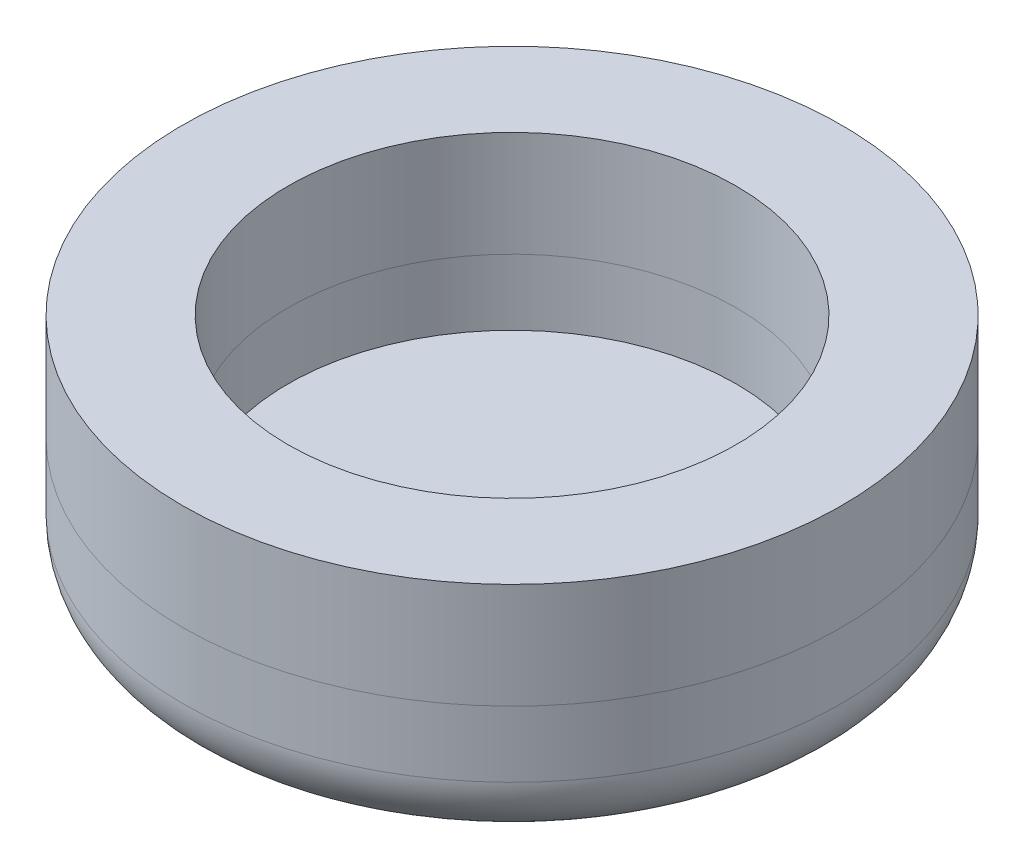
ISO-10303-21;
HEADER;
FILE_DESCRIPTION(('STEP AP214'),'2;1');
FILE_NAME('part.step','',(''),(''),'','','');
FILE_SCHEMA(('AUTOMOTIVE_DESIGN { 1 0 10303 214 1 1 1 1 }'));
ENDSEC;
DATA;
#1=APPLICATION_CONTEXT('core data for automotive mechanical design processes');
#2=APPLICATION_PROTOCOL_DEFINITION('international standard','automotive_design',2000,#1);
#3=PRODUCT_CONTEXT('',#1,'mechanical');
#4=PRODUCT('Part','Part','',(#3));
#5=PRODUCT_RELATED_PRODUCT_CATEGORY('part','',(#4));
#6=PRODUCT_DEFINITION_FORMATION('','',#4);
#7=PRODUCT_DEFINITION_CONTEXT('part definition',#1,'design');
#8=PRODUCT_DEFINITION('design','',#6,#7);
#9=PRODUCT_DEFINITION_SHAPE('','',#8);
#10=(LENGTH_UNIT() NAMED_UNIT(*) SI_UNIT(.MILLI.,.METRE.));
#11=(NAMED_UNIT(*) PLANE_ANGLE_UNIT() SI_UNIT($,.RADIAN.));
#12=(NAMED_UNIT(*) SI_UNIT($,.STERADIAN.) SOLID_ANGLE_UNIT());
#13=UNCERTAINTY_MEASURE_WITH_UNIT(LENGTH_MEASURE(1.E-05),#10,'distance_accuracy_value','');
#14=(GEOMETRIC_REPRESENTATION_CONTEXT(3) GLOBAL_UNCERTAINTY_ASSIGNED_CONTEXT((#13)) GLOBAL_UNIT_ASSIGNED_CONTEXT((#10,
#11,#12)) REPRESENTATION_CONTEXT('',''));
#15=CARTESIAN_POINT('',(0.,0.,0.));
#16=DIRECTION('',(0.,0.,1.));
#17=DIRECTION('',(1.,0.,0.));
#18=AXIS2_PLACEMENT_3D('',#15,#16,#17);
#19=CARTESIAN_POINT('',(0.,4.572,0.));
#20=DIRECTION('',(0.,1.,0.));
#21=DIRECTION('',(0.,0.,1.));
#22=AXIS2_PLACEMENT_3D('',#19,#20,#21);
#23=PLANE('',#22);
#24=CARTESIAN_POINT('',(0.,4.572,0.));
#25=DIRECTION('',(0.,1.,0.));
#26=DIRECTION('',(0.,0.,1.));
#27=AXIS2_PLACEMENT_3D('',#24,#25,#26);
#28=CIRCLE('',#27,4.318);
#29=CARTESIAN_POINT('',(0.,4.572,4.318));
#30=VERTEX_POINT('',#29);
#31=EDGE_CURVE('E67',#30,#30,#28,.T.);
#32=ORIENTED_EDGE('',*,*,#31,.F.);
#33=EDGE_LOOP('',(#32));
#34=FACE_BOUND('',#33,.T.);
#35=CARTESIAN_POINT('',(0.,4.572,0.));
#36=DIRECTION('',(0.,1.,0.));
#37=DIRECTION('',(0.,0.,1.));
#38=AXIS2_PLACEMENT_3D('',#35,#36,#37);
#39=CIRCLE('',#38,6.35);
#40=CARTESIAN_POINT('',(0.,4.572,6.35));
#41=VERTEX_POINT('',#40);
#42=EDGE_CURVE('E11',#41,#41,#39,.T.);
#43=ORIENTED_EDGE('',*,*,#42,.T.);
#44=EDGE_LOOP('',(#43));
#45=FACE_BOUND('',#44,.T.);
#46=ADVANCED_FACE('F53',(#34,#45),#23,.T.);
#47=CARTESIAN_POINT('',(0.,2.54,0.));
#48=DIRECTION('',(0.,1.,0.));
#49=DIRECTION('',(0.,0.,1.));
#50=AXIS2_PLACEMENT_3D('',#47,#48,#49);
#51=PLANE('',#50);
#52=CARTESIAN_POINT('',(0.,2.54,0.));
#53=DIRECTION('',(0.,1.,0.));
#54=DIRECTION('',(0.,0.,1.));
#55=AXIS2_PLACEMENT_3D('',#52,#53,#54);
#56=CIRCLE('',#55,4.318);
#57=CARTESIAN_POINT('',(0.,2.54,4.318));
#58=VERTEX_POINT('',#57);
#59=EDGE_CURVE('E57',#58,#58,#56,.T.);
#60=ORIENTED_EDGE('',*,*,#59,.T.);
#61=EDGE_LOOP('',(#60));
#62=FACE_BOUND('',#61,.T.);
#63=CARTESIAN_POINT('',(0.,2.54,0.));
#64=DIRECTION('',(0.,1.,0.));
#65=DIRECTION('',(0.,0.,1.));
#66=AXIS2_PLACEMENT_3D('',#63,#64,#65);
#67=CIRCLE('',#66,6.35);
#68=CARTESIAN_POINT('',(0.,2.54,6.35));
#69=VERTEX_POINT('',#68);
#70=EDGE_CURVE('E61',#69,#69,#67,.T.);
#71=ORIENTED_EDGE('',*,*,#70,.F.);
#72=EDGE_LOOP('',(#71));
#73=FACE_BOUND('',#72,.T.);
#74=ADVANCED_FACE('F74',(#62,#73),#51,.F.);
#75=CARTESIAN_POINT('',(0.,4.572,0.));
#76=DIRECTION('',(0.,-1.,0.));
#77=DIRECTION('',(0.,0.,-1.));
#78=AXIS2_PLACEMENT_3D('',#75,#76,#77);
#79=CYLINDRICAL_SURFACE('',#78,6.35);
#80=ORIENTED_EDGE('',*,*,#42,.F.);
#81=EDGE_LOOP('',(#80));
#82=FACE_BOUND('',#81,.T.);
#83=ORIENTED_EDGE('',*,*,#70,.T.);
#84=EDGE_LOOP('',(#83));
#85=FACE_BOUND('',#84,.T.);
#86=ADVANCED_FACE('F55',(#82,#85),#79,.T.);
#87=CARTESIAN_POINT('',(0.,-10.943148324654,0.));
#88=DIRECTION('',(0.,1.,0.));
#89=DIRECTION('',(0.,0.,1.));
#90=AXIS2_PLACEMENT_3D('',#87,#88,#89);
#91=CYLINDRICAL_SURFACE('',#90,4.318);
#92=ORIENTED_EDGE('',*,*,#31,.T.);
#93=EDGE_LOOP('',(#92));
#94=FACE_BOUND('',#93,.T.);
#95=ORIENTED_EDGE('',*,*,#59,.F.);
#96=EDGE_LOOP('',(#95));
#97=FACE_BOUND('',#96,.T.);
#98=ADVANCED_FACE('F77',(#94,#97),#91,.F.);
#99=CLOSED_SHELL('',(#46,#74,#86,#98));
#100=MANIFOLD_SOLID_BREP('B2',#99);
#101=CARTESIAN_POINT('',(0.,2.54,0.));
#102=DIRECTION('',(0.,-1.,0.));
#103=DIRECTION('',(0.,0.,-1.));
#104=AXIS2_PLACEMENT_3D('',#101,#102,#103);
#105=CYLINDRICAL_SURFACE('',#104,6.35);
#106=CARTESIAN_POINT('',(0.,1.27,0.));
#107=DIRECTION('',(0.,1.,0.));
#108=DIRECTION('',(0.,0.,1.));
#109=AXIS2_PLACEMENT_3D('',#106,#107,#108);
#110=CIRCLE('',#109,6.35);
#111=CARTESIAN_POINT('',(0.,1.27,6.35));
#112=VERTEX_POINT('',#111);
#113=EDGE_CURVE('E115',#112,#112,#110,.T.);
#114=ORIENTED_EDGE('',*,*,#113,.T.);
#115=EDGE_LOOP('',(#114));
#116=FACE_BOUND('',#115,.T.);
#117=CARTESIAN_POINT('',(0.,2.54,0.));
#118=DIRECTION('',(0.,1.,0.));
#119=DIRECTION('',(0.,0.,1.));
#120=AXIS2_PLACEMENT_3D('',#117,#118,#119);
#121=CIRCLE('',#120,6.35);
#122=CARTESIAN_POINT('',(0.,2.54,6.35));
#123=VERTEX_POINT('',#122);
#124=EDGE_CURVE('E119',#123,#123,#121,.T.);
#125=ORIENTED_EDGE('',*,*,#124,.F.);
#126=EDGE_LOOP('',(#125));
#127=FACE_BOUND('',#126,.T.);
#128=ADVANCED_FACE('F107',(#116,#127),#105,.T.);
#129=CARTESIAN_POINT('',(0.,2.54,0.));
#130=DIRECTION('',(0.,1.,0.));
#131=DIRECTION('',(0.,0.,1.));
#132=AXIS2_PLACEMENT_3D('',#129,#130,#131);
#133=PLANE('',#132);
#134=CARTESIAN_POINT('',(0.,2.54,0.));
#135=DIRECTION('',(0.,1.,0.));
#136=DIRECTION('',(0.,0.,1.));
#137=AXIS2_PLACEMENT_3D('',#134,#135,#136);
#138=CIRCLE('',#137,4.318);
#139=CARTESIAN_POINT('',(0.,2.54,4.318));
#140=VERTEX_POINT('',#139);
#141=EDGE_CURVE('E111',#140,#140,#138,.T.);
#142=ORIENTED_EDGE('',*,*,#141,.F.);
#143=EDGE_LOOP('',(#142));
#144=FACE_BOUND('',#143,.T.);
#145=ORIENTED_EDGE('',*,*,#124,.T.);
#146=EDGE_LOOP('',(#145));
#147=FACE_BOUND('',#146,.T.);
#148=ADVANCED_FACE('F133',(#144,#147),#133,.T.);
#149=CARTESIAN_POINT('',(0.,0.,0.));
#150=DIRECTION('',(0.,1.,0.));
#151=DIRECTION('',(0.,0.,1.));
#152=AXIS2_PLACEMENT_3D('',#149,#150,#151);
#153=PLANE('',#152);
#154=CARTESIAN_POINT('',(0.,0.,0.));
#155=DIRECTION('',(0.,1.,0.));
#156=DIRECTION('',(0.,0.,1.));
#157=AXIS2_PLACEMENT_3D('',#154,#155,#156);
#158=CIRCLE('',#157,5.08);
#159=CARTESIAN_POINT('',(0.,0.,5.08));
#160=VERTEX_POINT('',#159);
#161=EDGE_CURVE('E52',#160,#160,#158,.F.);
#162=ORIENTED_EDGE('',*,*,#161,.T.);
#163=EDGE_LOOP('',(#162));
#164=FACE_BOUND('',#163,.T.);
#165=ADVANCED_FACE('F136',(#164),#153,.F.);
#166=CARTESIAN_POINT('',(0.,1.27,0.));
#167=DIRECTION('',(0.,1.,0.));
#168=DIRECTION('',(0.,0.,1.));
#169=AXIS2_PLACEMENT_3D('',#166,#167,#168);
#170=TOROIDAL_SURFACE('',#169,5.08,1.27);
#171=ORIENTED_EDGE('',*,*,#161,.F.);
#172=EDGE_LOOP('',(#171));
#173=FACE_BOUND('',#172,.T.);
#174=ORIENTED_EDGE('',*,*,#113,.F.);
#175=EDGE_LOOP('',(#174));
#176=FACE_BOUND('',#175,.T.);
#177=ADVANCED_FACE('F109',(#173,#176),#170,.T.);
#178=CARTESIAN_POINT('',(0.,-10.943148324654,0.));
#179=DIRECTION('',(0.,1.,0.));
#180=DIRECTION('',(0.,0.,1.));
#181=AXIS2_PLACEMENT_3D('',#178,#179,#180);
#182=CYLINDRICAL_SURFACE('',#181,4.318);
#183=ORIENTED_EDGE('',*,*,#141,.T.);
#184=EDGE_LOOP('',(#183));
#185=FACE_BOUND('',#184,.T.);
#186=CARTESIAN_POINT('',(0.,1.27,0.));
#187=DIRECTION('',(0.,1.,0.));
#188=DIRECTION('',(0.,0.,1.));
#189=AXIS2_PLACEMENT_3D('',#186,#187,#188);
#190=CIRCLE('',#189,4.318);
#191=CARTESIAN_POINT('',(0.,1.27,4.318));
#192=VERTEX_POINT('',#191);
#193=EDGE_CURVE('E124',#192,#192,#190,.F.);
#194=ORIENTED_EDGE('',*,*,#193,.T.);
#195=EDGE_LOOP('',(#194));
#196=FACE_BOUND('',#195,.T.);
#197=ADVANCED_FACE('F131',(#185,#196),#182,.F.);
#198=CARTESIAN_POINT('',(0.,1.27,0.));
#199=DIRECTION('',(0.,1.,0.));
#200=DIRECTION('',(0.,0.,1.));
#201=AXIS2_PLACEMENT_3D('',#198,#199,#200);
#202=PLANE('',#201);
#203=ORIENTED_EDGE('',*,*,#193,.F.);
#204=EDGE_LOOP('',(#203));
#205=FACE_BOUND('',#204,.T.);
#206=ADVANCED_FACE('F147',(#205),#202,.T.);
#207=CLOSED_SHELL('',(#128,#148,#165,#177,#197,#206));
#208=MANIFOLD_SOLID_BREP('B6',#207);
#209=ADVANCED_BREP_SHAPE_REPRESENTATION('',(#18,#100,#208),#14);
#210=SHAPE_DEFINITION_REPRESENTATION(#9,#209);
ENDSEC;
END-ISO-10303-21;
